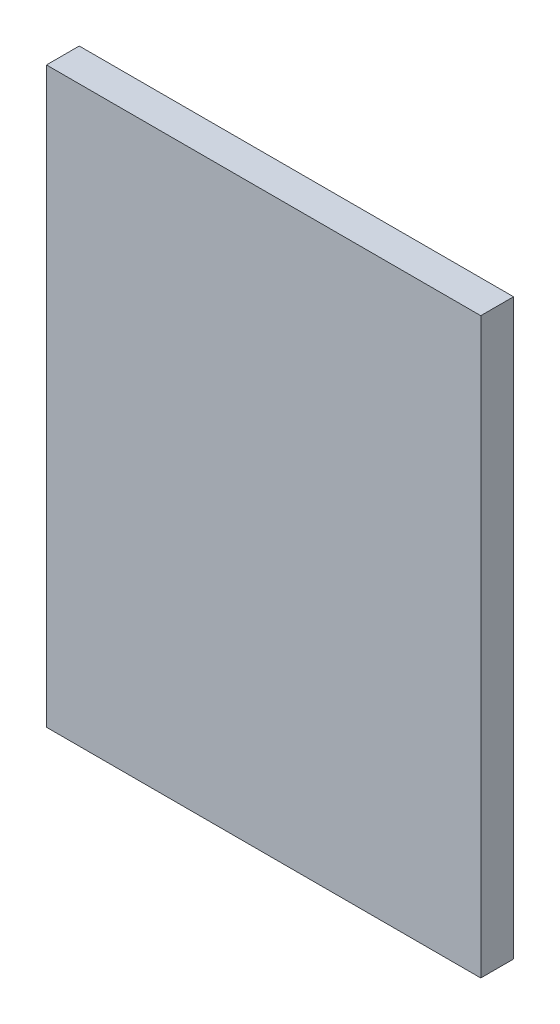
ISO-10303-21;
HEADER;
FILE_DESCRIPTION(('STEP AP214'),'2;1');
FILE_NAME('part.step','',(''),(''),'','','');
FILE_SCHEMA(('AUTOMOTIVE_DESIGN { 1 0 10303 214 1 1 1 1 }'));
ENDSEC;
DATA;
#1=APPLICATION_CONTEXT('core data for automotive mechanical design processes');
#2=APPLICATION_PROTOCOL_DEFINITION('international standard','automotive_design',2000,#1);
#3=PRODUCT_CONTEXT('',#1,'mechanical');
#4=PRODUCT('Part','Part','',(#3));
#5=PRODUCT_RELATED_PRODUCT_CATEGORY('part','',(#4));
#6=PRODUCT_DEFINITION_FORMATION('','',#4);
#7=PRODUCT_DEFINITION_CONTEXT('part definition',#1,'design');
#8=PRODUCT_DEFINITION('design','',#6,#7);
#9=PRODUCT_DEFINITION_SHAPE('','',#8);
#10=(LENGTH_UNIT() NAMED_UNIT(*) SI_UNIT(.MILLI.,.METRE.));
#11=(NAMED_UNIT(*) PLANE_ANGLE_UNIT() SI_UNIT($,.RADIAN.));
#12=(NAMED_UNIT(*) SI_UNIT($,.STERADIAN.) SOLID_ANGLE_UNIT());
#13=UNCERTAINTY_MEASURE_WITH_UNIT(LENGTH_MEASURE(1.E-05),#10,'distance_accuracy_value','');
#14=(GEOMETRIC_REPRESENTATION_CONTEXT(3) GLOBAL_UNCERTAINTY_ASSIGNED_CONTEXT((#13)) GLOBAL_UNIT_ASSIGNED_CONTEXT((#10,
#11,#12)) REPRESENTATION_CONTEXT('',''));
#15=CARTESIAN_POINT('',(0.,0.,0.));
#16=DIRECTION('',(0.,0.,1.));
#17=DIRECTION('',(1.,0.,0.));
#18=AXIS2_PLACEMENT_3D('',#15,#16,#17);
#19=CARTESIAN_POINT('',(13.25,17.5,2.));
#20=DIRECTION('',(-1.,0.,0.));
#21=DIRECTION('',(0.,-1.,0.));
#22=AXIS2_PLACEMENT_3D('',#19,#20,#21);
#23=PLANE('',#22);
#24=DIRECTION('',(0.,1.,0.));
#25=VECTOR('',#24,1.);
#26=CARTESIAN_POINT('',(13.25,17.5,0.));
#27=LINE('',#26,#25);
#28=CARTESIAN_POINT('',(13.25,-17.5,0.));
#29=VERTEX_POINT('',#28);
#30=CARTESIAN_POINT('',(13.25,17.5,0.));
#31=VERTEX_POINT('',#30);
#32=EDGE_CURVE('E96',#29,#31,#27,.T.);
#33=ORIENTED_EDGE('',*,*,#32,.T.);
#34=DIRECTION('',(0.,0.,-1.));
#35=VECTOR('',#34,1.);
#36=CARTESIAN_POINT('',(13.25,17.5,2.));
#37=LINE('',#36,#35);
#38=CARTESIAN_POINT('',(13.25,17.5,2.));
#39=VERTEX_POINT('',#38);
#40=EDGE_CURVE('E11',#39,#31,#37,.T.);
#41=ORIENTED_EDGE('',*,*,#40,.F.);
#42=DIRECTION('',(0.,1.,0.));
#43=VECTOR('',#42,1.);
#44=CARTESIAN_POINT('',(13.25,17.5,2.));
#45=LINE('',#44,#43);
#46=CARTESIAN_POINT('',(13.25,-17.5,2.));
#47=VERTEX_POINT('',#46);
#48=EDGE_CURVE('E84',#47,#39,#45,.T.);
#49=ORIENTED_EDGE('',*,*,#48,.F.);
#50=DIRECTION('',(0.,0.,-1.));
#51=VECTOR('',#50,1.);
#52=CARTESIAN_POINT('',(13.25,-17.5,2.));
#53=LINE('',#52,#51);
#54=EDGE_CURVE('E92',#47,#29,#53,.T.);
#55=ORIENTED_EDGE('',*,*,#54,.T.);
#56=EDGE_LOOP('',(#33,#41,#49,#55));
#57=FACE_BOUND('',#56,.T.);
#58=ADVANCED_FACE('F33',(#57),#23,.F.);
#59=CARTESIAN_POINT('',(-13.25,17.5,2.));
#60=DIRECTION('',(0.,-1.,0.));
#61=DIRECTION('',(0.,0.,-1.));
#62=AXIS2_PLACEMENT_3D('',#59,#60,#61);
#63=PLANE('',#62);
#64=DIRECTION('',(-1.,0.,0.));
#65=VECTOR('',#64,1.);
#66=CARTESIAN_POINT('',(-13.25,17.5,0.));
#67=LINE('',#66,#65);
#68=CARTESIAN_POINT('',(-13.25,17.5,0.));
#69=VERTEX_POINT('',#68);
#70=EDGE_CURVE('E88',#31,#69,#67,.T.);
#71=ORIENTED_EDGE('',*,*,#70,.T.);
#72=DIRECTION('',(0.,0.,-1.));
#73=VECTOR('',#72,1.);
#74=CARTESIAN_POINT('',(-13.25,17.5,2.));
#75=LINE('',#74,#73);
#76=CARTESIAN_POINT('',(-13.25,17.5,2.));
#77=VERTEX_POINT('',#76);
#78=EDGE_CURVE('E41',#77,#69,#75,.T.);
#79=ORIENTED_EDGE('',*,*,#78,.F.);
#80=DIRECTION('',(-1.,0.,0.));
#81=VECTOR('',#80,1.);
#82=CARTESIAN_POINT('',(-13.25,17.5,2.));
#83=LINE('',#82,#81);
#84=EDGE_CURVE('E79',#39,#77,#83,.T.);
#85=ORIENTED_EDGE('',*,*,#84,.F.);
#86=ORIENTED_EDGE('',*,*,#40,.T.);
#87=EDGE_LOOP('',(#71,#79,#85,#86));
#88=FACE_BOUND('',#87,.T.);
#89=ADVANCED_FACE('F87',(#88),#63,.F.);
#90=CARTESIAN_POINT('',(-13.25,17.5,2.));
#91=DIRECTION('',(1.,0.,0.));
#92=DIRECTION('',(0.,1.,0.));
#93=AXIS2_PLACEMENT_3D('',#90,#91,#92);
#94=PLANE('',#93);
#95=DIRECTION('',(0.,-1.,0.));
#96=VECTOR('',#95,1.);
#97=CARTESIAN_POINT('',(-13.25,17.5,0.));
#98=LINE('',#97,#96);
#99=CARTESIAN_POINT('',(-13.25,-17.5,0.));
#100=VERTEX_POINT('',#99);
#101=EDGE_CURVE('E66',#69,#100,#98,.T.);
#102=ORIENTED_EDGE('',*,*,#101,.T.);
#103=DIRECTION('',(0.,0.,-1.));
#104=VECTOR('',#103,1.);
#105=CARTESIAN_POINT('',(-13.25,-17.5,2.));
#106=LINE('',#105,#104);
#107=CARTESIAN_POINT('',(-13.25,-17.5,2.));
#108=VERTEX_POINT('',#107);
#109=EDGE_CURVE('E89',#108,#100,#106,.T.);
#110=ORIENTED_EDGE('',*,*,#109,.F.);
#111=DIRECTION('',(0.,-1.,0.));
#112=VECTOR('',#111,1.);
#113=CARTESIAN_POINT('',(-13.25,17.5,2.));
#114=LINE('',#113,#112);
#115=EDGE_CURVE('E82',#77,#108,#114,.T.);
#116=ORIENTED_EDGE('',*,*,#115,.F.);
#117=ORIENTED_EDGE('',*,*,#78,.T.);
#118=EDGE_LOOP('',(#102,#110,#116,#117));
#119=FACE_BOUND('',#118,.T.);
#120=ADVANCED_FACE('F90',(#119),#94,.F.);
#121=CARTESIAN_POINT('',(-13.25,-17.5,2.));
#122=DIRECTION('',(0.,1.,0.));
#123=DIRECTION('',(0.,0.,1.));
#124=AXIS2_PLACEMENT_3D('',#121,#122,#123);
#125=PLANE('',#124);
#126=DIRECTION('',(1.,0.,0.));
#127=VECTOR('',#126,1.);
#128=CARTESIAN_POINT('',(-13.25,-17.5,0.));
#129=LINE('',#128,#127);
#130=EDGE_CURVE('E72',#100,#29,#129,.T.);
#131=ORIENTED_EDGE('',*,*,#130,.T.);
#132=ORIENTED_EDGE('',*,*,#54,.F.);
#133=DIRECTION('',(1.,0.,0.));
#134=VECTOR('',#133,1.);
#135=CARTESIAN_POINT('',(-13.25,-17.5,2.));
#136=LINE('',#135,#134);
#137=EDGE_CURVE('E49',#108,#47,#136,.T.);
#138=ORIENTED_EDGE('',*,*,#137,.F.);
#139=ORIENTED_EDGE('',*,*,#109,.T.);
#140=EDGE_LOOP('',(#131,#132,#138,#139));
#141=FACE_BOUND('',#140,.T.);
#142=ADVANCED_FACE('F103',(#141),#125,.F.);
#143=CARTESIAN_POINT('',(0.,0.,2.));
#144=DIRECTION('',(0.,0.,1.));
#145=DIRECTION('',(1.,0.,0.));
#146=AXIS2_PLACEMENT_3D('',#143,#144,#145);
#147=PLANE('',#146);
#148=ORIENTED_EDGE('',*,*,#48,.T.);
#149=ORIENTED_EDGE('',*,*,#84,.T.);
#150=ORIENTED_EDGE('',*,*,#115,.T.);
#151=ORIENTED_EDGE('',*,*,#137,.T.);
#152=EDGE_LOOP('',(#148,#149,#150,#151));
#153=FACE_BOUND('',#152,.T.);
#154=ADVANCED_FACE('F80',(#153),#147,.T.);
#155=CARTESIAN_POINT('',(0.,0.,0.));
#156=DIRECTION('',(0.,0.,1.));
#157=DIRECTION('',(1.,0.,0.));
#158=AXIS2_PLACEMENT_3D('',#155,#156,#157);
#159=PLANE('',#158);
#160=ORIENTED_EDGE('',*,*,#32,.F.);
#161=ORIENTED_EDGE('',*,*,#130,.F.);
#162=ORIENTED_EDGE('',*,*,#101,.F.);
#163=ORIENTED_EDGE('',*,*,#70,.F.);
#164=EDGE_LOOP('',(#160,#161,#162,#163));
#165=FACE_BOUND('',#164,.T.);
#166=ADVANCED_FACE('F106',(#165),#159,.F.);
#167=CLOSED_SHELL('',(#58,#89,#120,#142,#154,#166));
#168=MANIFOLD_SOLID_BREP('B2',#167);
#169=ADVANCED_BREP_SHAPE_REPRESENTATION('',(#18,#168),#14);
#170=SHAPE_DEFINITION_REPRESENTATION(#9,#169);
ENDSEC;
END-ISO-10303-21;
